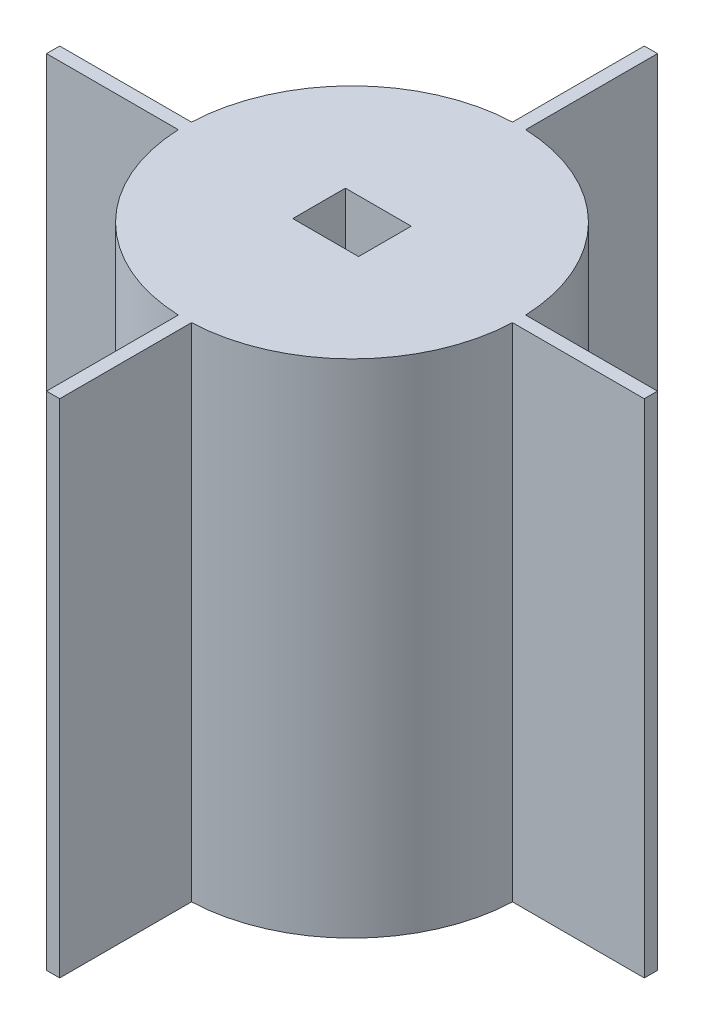
ISO-10303-21;
HEADER;
FILE_DESCRIPTION(('STEP AP214'),'2;1');
FILE_NAME('part.step','',(''),(''),'','','');
FILE_SCHEMA(('AUTOMOTIVE_DESIGN { 1 0 10303 214 1 1 1 1 }'));
ENDSEC;
DATA;
#1=APPLICATION_CONTEXT('core data for automotive mechanical design processes');
#2=APPLICATION_PROTOCOL_DEFINITION('international standard','automotive_design',2000,#1);
#3=PRODUCT_CONTEXT('',#1,'mechanical');
#4=PRODUCT('Part','Part','',(#3));
#5=PRODUCT_RELATED_PRODUCT_CATEGORY('part','',(#4));
#6=PRODUCT_DEFINITION_FORMATION('','',#4);
#7=PRODUCT_DEFINITION_CONTEXT('part definition',#1,'design');
#8=PRODUCT_DEFINITION('design','',#6,#7);
#9=PRODUCT_DEFINITION_SHAPE('','',#8);
#10=(LENGTH_UNIT() NAMED_UNIT(*) SI_UNIT(.MILLI.,.METRE.));
#11=(NAMED_UNIT(*) PLANE_ANGLE_UNIT() SI_UNIT($,.RADIAN.));
#12=(NAMED_UNIT(*) SI_UNIT($,.STERADIAN.) SOLID_ANGLE_UNIT());
#13=UNCERTAINTY_MEASURE_WITH_UNIT(LENGTH_MEASURE(1.E-05),#10,'distance_accuracy_value','');
#14=(GEOMETRIC_REPRESENTATION_CONTEXT(3) GLOBAL_UNCERTAINTY_ASSIGNED_CONTEXT((#13)) GLOBAL_UNIT_ASSIGNED_CONTEXT((#10,
#11,#12)) REPRESENTATION_CONTEXT('',''));
#15=CARTESIAN_POINT('',(0.,0.,0.));
#16=DIRECTION('',(0.,0.,1.));
#17=DIRECTION('',(1.,0.,0.));
#18=AXIS2_PLACEMENT_3D('',#15,#16,#17);
#19=CARTESIAN_POINT('',(0.,38.1,0.));
#20=DIRECTION('',(0.,-1.,0.));
#21=DIRECTION('',(0.,0.,-1.));
#22=AXIS2_PLACEMENT_3D('',#19,#20,#21);
#23=CYLINDRICAL_SURFACE('',#22,12.7);
#24=DIRECTION('',(0.,-1.,0.));
#25=VECTOR('',#24,1.);
#26=CARTESIAN_POINT('',(-0.500000000000133,38.1,12.6901536633722));
#27=LINE('',#26,#25);
#28=CARTESIAN_POINT('',(-0.500000000000133,38.1,12.6901536633722));
#29=VERTEX_POINT('',#28);
#30=CARTESIAN_POINT('',(-0.500000000000133,0.,12.6901536633722));
#31=VERTEX_POINT('',#30);
#32=EDGE_CURVE('E70',#29,#31,#27,.T.);
#33=ORIENTED_EDGE('',*,*,#32,.F.);
#34=CARTESIAN_POINT('',(0.,38.1,0.));
#35=DIRECTION('',(0.,1.,0.));
#36=DIRECTION('',(0.,0.,1.));
#37=AXIS2_PLACEMENT_3D('',#34,#35,#36);
#38=CIRCLE('',#37,12.7);
#39=CARTESIAN_POINT('',(-12.6901536633722,38.1,0.5));
#40=VERTEX_POINT('',#39);
#41=EDGE_CURVE('E449',#40,#29,#38,.T.);
#42=ORIENTED_EDGE('',*,*,#41,.F.);
#43=DIRECTION('',(0.,-1.,0.));
#44=VECTOR('',#43,1.);
#45=CARTESIAN_POINT('',(-12.6901536633722,38.1,0.5));
#46=LINE('',#45,#44);
#47=CARTESIAN_POINT('',(-12.6901536633722,0.,0.5));
#48=VERTEX_POINT('',#47);
#49=EDGE_CURVE('E254',#40,#48,#46,.T.);
#50=ORIENTED_EDGE('',*,*,#49,.T.);
#51=CARTESIAN_POINT('',(0.,0.,0.));
#52=DIRECTION('',(0.,1.,0.));
#53=DIRECTION('',(0.,0.,1.));
#54=AXIS2_PLACEMENT_3D('',#51,#52,#53);
#55=CIRCLE('',#54,12.7);
#56=EDGE_CURVE('E455',#48,#31,#55,.T.);
#57=ORIENTED_EDGE('',*,*,#56,.T.);
#58=EDGE_LOOP('',(#33,#42,#50,#57));
#59=FACE_BOUND('',#58,.T.);
#60=ADVANCED_FACE('F45',(#59),#23,.T.);
#61=DIRECTION('',(0.,-1.,0.));
#62=VECTOR('',#61,1.);
#63=CARTESIAN_POINT('',(-12.6901536633722,38.1,-0.5));
#64=LINE('',#63,#62);
#65=CARTESIAN_POINT('',(-12.6901536633722,38.1,-0.5));
#66=VERTEX_POINT('',#65);
#67=CARTESIAN_POINT('',(-12.6901536633722,0.,-0.5));
#68=VERTEX_POINT('',#67);
#69=EDGE_CURVE('E263',#66,#68,#64,.T.);
#70=ORIENTED_EDGE('',*,*,#69,.F.);
#71=CARTESIAN_POINT('',(-0.499999999999955,38.1,-12.6901536633722));
#72=VERTEX_POINT('',#71);
#73=EDGE_CURVE('E55',#72,#66,#38,.T.);
#74=ORIENTED_EDGE('',*,*,#73,.F.);
#75=DIRECTION('',(0.,-1.,0.));
#76=VECTOR('',#75,1.);
#77=CARTESIAN_POINT('',(-0.499999999999955,38.1,-12.6901536633722));
#78=LINE('',#77,#76);
#79=CARTESIAN_POINT('',(-0.499999999999955,0.,-12.6901536633722));
#80=VERTEX_POINT('',#79);
#81=EDGE_CURVE('E290',#72,#80,#78,.T.);
#82=ORIENTED_EDGE('',*,*,#81,.T.);
#83=EDGE_CURVE('E446',#80,#68,#55,.T.);
#84=ORIENTED_EDGE('',*,*,#83,.T.);
#85=EDGE_LOOP('',(#70,#74,#82,#84));
#86=FACE_BOUND('',#85,.T.);
#87=ADVANCED_FACE('F412',(#86),#23,.T.);
#88=DIRECTION('',(0.,-1.,0.));
#89=VECTOR('',#88,1.);
#90=CARTESIAN_POINT('',(0.500000000000044,38.1,-12.6901536633722));
#91=LINE('',#90,#89);
#92=CARTESIAN_POINT('',(0.500000000000044,38.1,-12.6901536633722));
#93=VERTEX_POINT('',#92);
#94=CARTESIAN_POINT('',(0.500000000000044,0.,-12.6901536633722));
#95=VERTEX_POINT('',#94);
#96=EDGE_CURVE('E299',#93,#95,#91,.T.);
#97=ORIENTED_EDGE('',*,*,#96,.F.);
#98=CARTESIAN_POINT('',(12.6901536633722,38.1,-0.5));
#99=VERTEX_POINT('',#98);
#100=EDGE_CURVE('E11',#99,#93,#38,.T.);
#101=ORIENTED_EDGE('',*,*,#100,.F.);
#102=DIRECTION('',(0.,-1.,0.));
#103=VECTOR('',#102,1.);
#104=CARTESIAN_POINT('',(12.6901536633722,38.1,-0.5));
#105=LINE('',#104,#103);
#106=CARTESIAN_POINT('',(12.6901536633722,0.,-0.5));
#107=VERTEX_POINT('',#106);
#108=EDGE_CURVE('E334',#107,#99,#105,.F.);
#109=ORIENTED_EDGE('',*,*,#108,.F.);
#110=EDGE_CURVE('E49',#107,#95,#55,.T.);
#111=ORIENTED_EDGE('',*,*,#110,.T.);
#112=EDGE_LOOP('',(#97,#101,#109,#111));
#113=FACE_BOUND('',#112,.T.);
#114=ADVANCED_FACE('F417',(#113),#23,.T.);
#115=CARTESIAN_POINT('',(0.499999999999866,38.1,12.6901536633722));
#116=VERTEX_POINT('',#115);
#117=CARTESIAN_POINT('',(12.6901536633722,38.1,0.5));
#118=VERTEX_POINT('',#117);
#119=EDGE_CURVE('E56',#116,#118,#38,.T.);
#120=ORIENTED_EDGE('',*,*,#119,.F.);
#121=DIRECTION('',(0.,-1.,0.));
#122=VECTOR('',#121,1.);
#123=CARTESIAN_POINT('',(0.499999999999866,38.1,12.6901536633722));
#124=LINE('',#123,#122);
#125=CARTESIAN_POINT('',(0.499999999999866,0.,12.6901536633722));
#126=VERTEX_POINT('',#125);
#127=EDGE_CURVE('E223',#116,#126,#124,.T.);
#128=ORIENTED_EDGE('',*,*,#127,.T.);
#129=CARTESIAN_POINT('',(12.6901536633722,0.,0.5));
#130=VERTEX_POINT('',#129);
#131=EDGE_CURVE('E192',#126,#130,#55,.T.);
#132=ORIENTED_EDGE('',*,*,#131,.T.);
#133=DIRECTION('',(0.,-1.,0.));
#134=VECTOR('',#133,1.);
#135=CARTESIAN_POINT('',(12.6901536633722,38.1,0.5));
#136=LINE('',#135,#134);
#137=EDGE_CURVE('E331',#130,#118,#136,.F.);
#138=ORIENTED_EDGE('',*,*,#137,.T.);
#139=EDGE_LOOP('',(#120,#128,#132,#138));
#140=FACE_BOUND('',#139,.T.);
#141=ADVANCED_FACE('F47',(#140),#23,.T.);
#142=CARTESIAN_POINT('',(0.,38.1,0.));
#143=DIRECTION('',(0.,1.,0.));
#144=DIRECTION('',(0.,0.,1.));
#145=AXIS2_PLACEMENT_3D('',#142,#143,#144);
#146=PLANE('',#145);
#147=ORIENTED_EDGE('',*,*,#41,.T.);
#148=DIRECTION('',(0.,0.,-1.));
#149=VECTOR('',#148,1.);
#150=CARTESIAN_POINT('',(-0.500000000000238,38.1,22.7));
#151=LINE('',#150,#149);
#152=CARTESIAN_POINT('',(-0.500000000000238,38.1,22.7));
#153=VERTEX_POINT('',#152);
#154=EDGE_CURVE('E214',#153,#29,#151,.T.);
#155=ORIENTED_EDGE('',*,*,#154,.F.);
#156=DIRECTION('',(-1.,0.,0.));
#157=VECTOR('',#156,1.);
#158=CARTESIAN_POINT('',(0.499999999999761,38.1,22.7));
#159=LINE('',#158,#157);
#160=CARTESIAN_POINT('',(0.499999999999761,38.1,22.7));
#161=VERTEX_POINT('',#160);
#162=EDGE_CURVE('E221',#161,#153,#159,.T.);
#163=ORIENTED_EDGE('',*,*,#162,.F.);
#164=DIRECTION('',(0.,0.,-1.));
#165=VECTOR('',#164,1.);
#166=CARTESIAN_POINT('',(0.499999999999761,38.1,22.7));
#167=LINE('',#166,#165);
#168=EDGE_CURVE('E209',#161,#116,#167,.T.);
#169=ORIENTED_EDGE('',*,*,#168,.T.);
#170=ORIENTED_EDGE('',*,*,#119,.T.);
#171=DIRECTION('',(1.,0.,0.));
#172=VECTOR('',#171,1.);
#173=CARTESIAN_POINT('',(2.5,38.1,0.5));
#174=LINE('',#173,#172);
#175=CARTESIAN_POINT('',(22.7,38.1,0.5));
#176=VERTEX_POINT('',#175);
#177=EDGE_CURVE('E319',#118,#176,#174,.T.);
#178=ORIENTED_EDGE('',*,*,#177,.T.);
#179=DIRECTION('',(0.,0.,-1.));
#180=VECTOR('',#179,1.);
#181=CARTESIAN_POINT('',(22.7,38.1,0.5));
#182=LINE('',#181,#180);
#183=CARTESIAN_POINT('',(22.7,38.1,-0.5));
#184=VERTEX_POINT('',#183);
#185=EDGE_CURVE('E315',#176,#184,#182,.T.);
#186=ORIENTED_EDGE('',*,*,#185,.T.);
#187=DIRECTION('',(1.,0.,0.));
#188=VECTOR('',#187,1.);
#189=CARTESIAN_POINT('',(2.5,38.1,-0.5));
#190=LINE('',#189,#188);
#191=EDGE_CURVE('E303',#99,#184,#190,.T.);
#192=ORIENTED_EDGE('',*,*,#191,.F.);
#193=ORIENTED_EDGE('',*,*,#100,.T.);
#194=DIRECTION('',(0.,0.,1.));
#195=VECTOR('',#194,1.);
#196=CARTESIAN_POINT('',(0.500000000000079,38.1,-22.7));
#197=LINE('',#196,#195);
#198=CARTESIAN_POINT('',(0.500000000000079,38.1,-22.7));
#199=VERTEX_POINT('',#198);
#200=EDGE_CURVE('E282',#199,#93,#197,.T.);
#201=ORIENTED_EDGE('',*,*,#200,.F.);
#202=DIRECTION('',(1.,0.,0.));
#203=VECTOR('',#202,1.);
#204=CARTESIAN_POINT('',(-0.49999999999992,38.1,-22.7));
#205=LINE('',#204,#203);
#206=CARTESIAN_POINT('',(-0.49999999999992,38.1,-22.7));
#207=VERTEX_POINT('',#206);
#208=EDGE_CURVE('E286',#207,#199,#205,.T.);
#209=ORIENTED_EDGE('',*,*,#208,.F.);
#210=DIRECTION('',(0.,0.,1.));
#211=VECTOR('',#210,1.);
#212=CARTESIAN_POINT('',(-0.49999999999992,38.1,-22.7));
#213=LINE('',#212,#211);
#214=EDGE_CURVE('E278',#207,#72,#213,.T.);
#215=ORIENTED_EDGE('',*,*,#214,.T.);
#216=ORIENTED_EDGE('',*,*,#73,.T.);
#217=DIRECTION('',(1.,0.,0.));
#218=VECTOR('',#217,1.);
#219=CARTESIAN_POINT('',(-22.7,38.1,-0.5));
#220=LINE('',#219,#218);
#221=CARTESIAN_POINT('',(-22.7,38.1,-0.5));
#222=VERTEX_POINT('',#221);
#223=EDGE_CURVE('E246',#222,#66,#220,.T.);
#224=ORIENTED_EDGE('',*,*,#223,.F.);
#225=DIRECTION('',(0.,0.,-1.));
#226=VECTOR('',#225,1.);
#227=CARTESIAN_POINT('',(-22.7,38.1,0.5));
#228=LINE('',#227,#226);
#229=CARTESIAN_POINT('',(-22.7,38.1,0.5));
#230=VERTEX_POINT('',#229);
#231=EDGE_CURVE('E250',#230,#222,#228,.T.);
#232=ORIENTED_EDGE('',*,*,#231,.F.);
#233=DIRECTION('',(1.,0.,0.));
#234=VECTOR('',#233,1.);
#235=CARTESIAN_POINT('',(-22.7,38.1,0.5));
#236=LINE('',#235,#234);
#237=EDGE_CURVE('E242',#230,#40,#236,.T.);
#238=ORIENTED_EDGE('',*,*,#237,.T.);
#239=EDGE_LOOP('',(#147,#155,#163,#169,#170,#178,#186,#192,#193,#201,#209,#215,#216,#224,#232,#238));
#240=FACE_BOUND('',#239,.T.);
#241=DIRECTION('',(1.,0.,0.));
#242=VECTOR('',#241,1.);
#243=CARTESIAN_POINT('',(2.5,38.1,2.000000064));
#244=LINE('',#243,#242);
#245=CARTESIAN_POINT('',(-2.5,38.1,2.000000064));
#246=VERTEX_POINT('',#245);
#247=CARTESIAN_POINT('',(2.5,38.1,2.000000064));
#248=VERTEX_POINT('',#247);
#249=EDGE_CURVE('E357',#246,#248,#244,.T.);
#250=ORIENTED_EDGE('',*,*,#249,.F.);
#251=DIRECTION('',(0.,0.,1.));
#252=VECTOR('',#251,1.);
#253=CARTESIAN_POINT('',(-2.5,38.1,2.000000064));
#254=LINE('',#253,#252);
#255=CARTESIAN_POINT('',(-2.5,38.1,-2.000000064));
#256=VERTEX_POINT('',#255);
#257=EDGE_CURVE('E338',#256,#246,#254,.T.);
#258=ORIENTED_EDGE('',*,*,#257,.F.);
#259=DIRECTION('',(-1.,0.,0.));
#260=VECTOR('',#259,1.);
#261=CARTESIAN_POINT('',(2.5,38.1,-2.000000064));
#262=LINE('',#261,#260);
#263=CARTESIAN_POINT('',(2.5,38.1,-2.000000064));
#264=VERTEX_POINT('',#263);
#265=EDGE_CURVE('E343',#264,#256,#262,.T.);
#266=ORIENTED_EDGE('',*,*,#265,.F.);
#267=DIRECTION('',(0.,0.,-1.));
#268=VECTOR('',#267,1.);
#269=CARTESIAN_POINT('',(2.5,38.1,2.000000064));
#270=LINE('',#269,#268);
#271=EDGE_CURVE('E361',#248,#264,#270,.T.);
#272=ORIENTED_EDGE('',*,*,#271,.F.);
#273=EDGE_LOOP('',(#250,#258,#266,#272));
#274=FACE_BOUND('',#273,.T.);
#275=ADVANCED_FACE('F389',(#240,#274),#146,.T.);
#276=CARTESIAN_POINT('',(0.,0.,0.));
#277=DIRECTION('',(0.,1.,0.));
#278=DIRECTION('',(0.,0.,1.));
#279=AXIS2_PLACEMENT_3D('',#276,#277,#278);
#280=PLANE('',#279);
#281=ORIENTED_EDGE('',*,*,#131,.F.);
#282=DIRECTION('',(0.,0.,1.));
#283=VECTOR('',#282,1.);
#284=CARTESIAN_POINT('',(0.499999999999761,0.,22.7));
#285=LINE('',#284,#283);
#286=CARTESIAN_POINT('',(0.499999999999761,0.,22.7));
#287=VERTEX_POINT('',#286);
#288=EDGE_CURVE('E185',#126,#287,#285,.T.);
#289=ORIENTED_EDGE('',*,*,#288,.T.);
#290=DIRECTION('',(1.,0.,0.));
#291=VECTOR('',#290,1.);
#292=CARTESIAN_POINT('',(0.499999999999761,0.,22.7));
#293=LINE('',#292,#291);
#294=CARTESIAN_POINT('',(-0.500000000000238,0.,22.7));
#295=VERTEX_POINT('',#294);
#296=EDGE_CURVE('E189',#295,#287,#293,.T.);
#297=ORIENTED_EDGE('',*,*,#296,.F.);
#298=DIRECTION('',(0.,0.,1.));
#299=VECTOR('',#298,1.);
#300=CARTESIAN_POINT('',(-0.500000000000238,0.,22.7));
#301=LINE('',#300,#299);
#302=EDGE_CURVE('E204',#31,#295,#301,.T.);
#303=ORIENTED_EDGE('',*,*,#302,.F.);
#304=ORIENTED_EDGE('',*,*,#56,.F.);
#305=DIRECTION('',(-1.,0.,0.));
#306=VECTOR('',#305,1.);
#307=CARTESIAN_POINT('',(-22.7,0.,0.5));
#308=LINE('',#307,#306);
#309=CARTESIAN_POINT('',(-22.7,0.,0.5));
#310=VERTEX_POINT('',#309);
#311=EDGE_CURVE('E231',#48,#310,#308,.T.);
#312=ORIENTED_EDGE('',*,*,#311,.T.);
#313=DIRECTION('',(0.,0.,1.));
#314=VECTOR('',#313,1.);
#315=CARTESIAN_POINT('',(-22.7,0.,0.5));
#316=LINE('',#315,#314);
#317=CARTESIAN_POINT('',(-22.7,0.,-0.5));
#318=VERTEX_POINT('',#317);
#319=EDGE_CURVE('E234',#318,#310,#316,.T.);
#320=ORIENTED_EDGE('',*,*,#319,.F.);
#321=DIRECTION('',(-1.,0.,0.));
#322=VECTOR('',#321,1.);
#323=CARTESIAN_POINT('',(-22.7,0.,-0.5));
#324=LINE('',#323,#322);
#325=EDGE_CURVE('E239',#68,#318,#324,.T.);
#326=ORIENTED_EDGE('',*,*,#325,.F.);
#327=ORIENTED_EDGE('',*,*,#83,.F.);
#328=DIRECTION('',(0.,0.,-1.));
#329=VECTOR('',#328,1.);
#330=CARTESIAN_POINT('',(-0.49999999999992,0.,-22.7));
#331=LINE('',#330,#329);
#332=CARTESIAN_POINT('',(-0.49999999999992,0.,-22.7));
#333=VERTEX_POINT('',#332);
#334=EDGE_CURVE('E267',#80,#333,#331,.T.);
#335=ORIENTED_EDGE('',*,*,#334,.T.);
#336=DIRECTION('',(-1.,0.,0.));
#337=VECTOR('',#336,1.);
#338=CARTESIAN_POINT('',(-0.49999999999992,0.,-22.7));
#339=LINE('',#338,#337);
#340=CARTESIAN_POINT('',(0.500000000000079,0.,-22.7));
#341=VERTEX_POINT('',#340);
#342=EDGE_CURVE('E270',#341,#333,#339,.T.);
#343=ORIENTED_EDGE('',*,*,#342,.F.);
#344=DIRECTION('',(0.,0.,-1.));
#345=VECTOR('',#344,1.);
#346=CARTESIAN_POINT('',(0.500000000000079,0.,-22.7));
#347=LINE('',#346,#345);
#348=EDGE_CURVE('E275',#95,#341,#347,.T.);
#349=ORIENTED_EDGE('',*,*,#348,.F.);
#350=ORIENTED_EDGE('',*,*,#110,.F.);
#351=DIRECTION('',(-1.,0.,0.));
#352=VECTOR('',#351,1.);
#353=CARTESIAN_POINT('',(2.5,0.,-0.5));
#354=LINE('',#353,#352);
#355=CARTESIAN_POINT('',(22.7,0.,-0.5));
#356=VERTEX_POINT('',#355);
#357=EDGE_CURVE('E307',#356,#107,#354,.T.);
#358=ORIENTED_EDGE('',*,*,#357,.F.);
#359=DIRECTION('',(0.,0.,1.));
#360=VECTOR('',#359,1.);
#361=CARTESIAN_POINT('',(22.7,0.,0.5));
#362=LINE('',#361,#360);
#363=CARTESIAN_POINT('',(22.7,0.,0.5));
#364=VERTEX_POINT('',#363);
#365=EDGE_CURVE('E304',#356,#364,#362,.T.);
#366=ORIENTED_EDGE('',*,*,#365,.T.);
#367=DIRECTION('',(-1.,0.,0.));
#368=VECTOR('',#367,1.);
#369=CARTESIAN_POINT('',(2.5,0.,0.5));
#370=LINE('',#369,#368);
#371=EDGE_CURVE('E312',#364,#130,#370,.T.);
#372=ORIENTED_EDGE('',*,*,#371,.T.);
#373=EDGE_LOOP('',(#281,#289,#297,#303,#304,#312,#320,#326,#327,#335,#343,#349,#350,#358,#366,#372));
#374=FACE_BOUND('',#373,.T.);
#375=ADVANCED_FACE('F187',(#374),#280,.F.);
#376=CARTESIAN_POINT('',(-2.5,30.1,2.000000064));
#377=DIRECTION('',(-1.,0.,0.));
#378=DIRECTION('',(0.,0.,1.));
#379=AXIS2_PLACEMENT_3D('',#376,#377,#378);
#380=PLANE('',#379);
#381=DIRECTION('',(0.,1.,0.));
#382=VECTOR('',#381,1.);
#383=CARTESIAN_POINT('',(-2.5,30.1,2.000000064));
#384=LINE('',#383,#382);
#385=CARTESIAN_POINT('',(-2.5,30.1,2.000000064));
#386=VERTEX_POINT('',#385);
#387=EDGE_CURVE('E354',#386,#246,#384,.T.);
#388=ORIENTED_EDGE('',*,*,#387,.F.);
#389=DIRECTION('',(0.,0.,1.));
#390=VECTOR('',#389,1.);
#391=CARTESIAN_POINT('',(-2.5,30.1,2.000000064));
#392=LINE('',#391,#390);
#393=CARTESIAN_POINT('',(-2.5,30.1,-2.000000064));
#394=VERTEX_POINT('',#393);
#395=EDGE_CURVE('E339',#394,#386,#392,.T.);
#396=ORIENTED_EDGE('',*,*,#395,.F.);
#397=DIRECTION('',(0.,1.,0.));
#398=VECTOR('',#397,1.);
#399=CARTESIAN_POINT('',(-2.5,30.1,-2.000000064));
#400=LINE('',#399,#398);
#401=EDGE_CURVE('E367',#394,#256,#400,.T.);
#402=ORIENTED_EDGE('',*,*,#401,.T.);
#403=ORIENTED_EDGE('',*,*,#257,.T.);
#404=EDGE_LOOP('',(#388,#396,#402,#403));
#405=FACE_BOUND('',#404,.T.);
#406=ADVANCED_FACE('F400',(#405),#380,.F.);
#407=CARTESIAN_POINT('',(2.5,30.1,-2.000000064));
#408=DIRECTION('',(0.,0.,-1.));
#409=DIRECTION('',(-1.,0.,0.));
#410=AXIS2_PLACEMENT_3D('',#407,#408,#409);
#411=PLANE('',#410);
#412=ORIENTED_EDGE('',*,*,#265,.T.);
#413=ORIENTED_EDGE('',*,*,#401,.F.);
#414=DIRECTION('',(-1.,0.,0.));
#415=VECTOR('',#414,1.);
#416=CARTESIAN_POINT('',(2.5,30.1,-2.000000064));
#417=LINE('',#416,#415);
#418=CARTESIAN_POINT('',(2.5,30.1,-2.000000064));
#419=VERTEX_POINT('',#418);
#420=EDGE_CURVE('E350',#419,#394,#417,.T.);
#421=ORIENTED_EDGE('',*,*,#420,.F.);
#422=DIRECTION('',(0.,1.,0.));
#423=VECTOR('',#422,1.);
#424=CARTESIAN_POINT('',(2.5,30.1,-2.000000064));
#425=LINE('',#424,#423);
#426=EDGE_CURVE('E370',#419,#264,#425,.T.);
#427=ORIENTED_EDGE('',*,*,#426,.T.);
#428=EDGE_LOOP('',(#412,#413,#421,#427));
#429=FACE_BOUND('',#428,.T.);
#430=ADVANCED_FACE('F397',(#429),#411,.F.);
#431=CARTESIAN_POINT('',(2.5,30.1,2.000000064));
#432=DIRECTION('',(1.,0.,0.));
#433=DIRECTION('',(0.,0.,-1.));
#434=AXIS2_PLACEMENT_3D('',#431,#432,#433);
#435=PLANE('',#434);
#436=ORIENTED_EDGE('',*,*,#271,.T.);
#437=ORIENTED_EDGE('',*,*,#426,.F.);
#438=DIRECTION('',(0.,0.,-1.));
#439=VECTOR('',#438,1.);
#440=CARTESIAN_POINT('',(2.5,30.1,2.000000064));
#441=LINE('',#440,#439);
#442=CARTESIAN_POINT('',(2.5,30.1,2.000000064));
#443=VERTEX_POINT('',#442);
#444=EDGE_CURVE('E347',#443,#419,#441,.T.);
#445=ORIENTED_EDGE('',*,*,#444,.F.);
#446=DIRECTION('',(0.,1.,0.));
#447=VECTOR('',#446,1.);
#448=CARTESIAN_POINT('',(2.5,30.1,2.000000064));
#449=LINE('',#448,#447);
#450=EDGE_CURVE('E374',#443,#248,#449,.T.);
#451=ORIENTED_EDGE('',*,*,#450,.T.);
#452=EDGE_LOOP('',(#436,#437,#445,#451));
#453=FACE_BOUND('',#452,.T.);
#454=ADVANCED_FACE('F393',(#453),#435,.F.);
#455=CARTESIAN_POINT('',(2.5,30.1,2.000000064));
#456=DIRECTION('',(0.,0.,1.));
#457=DIRECTION('',(1.,0.,0.));
#458=AXIS2_PLACEMENT_3D('',#455,#456,#457);
#459=PLANE('',#458);
#460=ORIENTED_EDGE('',*,*,#249,.T.);
#461=ORIENTED_EDGE('',*,*,#450,.F.);
#462=DIRECTION('',(1.,0.,0.));
#463=VECTOR('',#462,1.);
#464=CARTESIAN_POINT('',(2.5,30.1,2.000000064));
#465=LINE('',#464,#463);
#466=EDGE_CURVE('E342',#386,#443,#465,.T.);
#467=ORIENTED_EDGE('',*,*,#466,.F.);
#468=ORIENTED_EDGE('',*,*,#387,.T.);
#469=EDGE_LOOP('',(#460,#461,#467,#468));
#470=FACE_BOUND('',#469,.T.);
#471=ADVANCED_FACE('F383',(#470),#459,.F.);
#472=CARTESIAN_POINT('',(0.,30.1,0.));
#473=DIRECTION('',(0.,1.,0.));
#474=DIRECTION('',(0.,0.,1.));
#475=AXIS2_PLACEMENT_3D('',#472,#473,#474);
#476=PLANE('',#475);
#477=ORIENTED_EDGE('',*,*,#395,.T.);
#478=ORIENTED_EDGE('',*,*,#466,.T.);
#479=ORIENTED_EDGE('',*,*,#444,.T.);
#480=ORIENTED_EDGE('',*,*,#420,.T.);
#481=EDGE_LOOP('',(#477,#478,#479,#480));
#482=FACE_BOUND('',#481,.T.);
#483=ADVANCED_FACE('F399',(#482),#476,.T.);
#484=CARTESIAN_POINT('',(2.5,-20.2247373283314,-0.5));
#485=DIRECTION('',(0.,0.,1.));
#486=DIRECTION('',(1.,0.,0.));
#487=AXIS2_PLACEMENT_3D('',#484,#485,#486);
#488=PLANE('',#487);
#489=ORIENTED_EDGE('',*,*,#357,.T.);
#490=ORIENTED_EDGE('',*,*,#108,.T.);
#491=ORIENTED_EDGE('',*,*,#191,.T.);
#492=DIRECTION('',(0.,1.,0.));
#493=VECTOR('',#492,1.);
#494=CARTESIAN_POINT('',(22.7,-20.2247373283314,-0.5));
#495=LINE('',#494,#493);
#496=EDGE_CURVE('E308',#356,#184,#495,.T.);
#497=ORIENTED_EDGE('',*,*,#496,.F.);
#498=EDGE_LOOP('',(#489,#490,#491,#497));
#499=FACE_BOUND('',#498,.T.);
#500=ADVANCED_FACE('F493',(#499),#488,.F.);
#501=CARTESIAN_POINT('',(2.5,-20.2247373283314,0.5));
#502=DIRECTION('',(0.,0.,1.));
#503=DIRECTION('',(1.,0.,0.));
#504=AXIS2_PLACEMENT_3D('',#501,#502,#503);
#505=PLANE('',#504);
#506=ORIENTED_EDGE('',*,*,#137,.F.);
#507=ORIENTED_EDGE('',*,*,#371,.F.);
#508=DIRECTION('',(0.,1.,0.));
#509=VECTOR('',#508,1.);
#510=CARTESIAN_POINT('',(22.7,-20.2247373283314,0.5));
#511=LINE('',#510,#509);
#512=EDGE_CURVE('E322',#364,#176,#511,.T.);
#513=ORIENTED_EDGE('',*,*,#512,.T.);
#514=ORIENTED_EDGE('',*,*,#177,.F.);
#515=EDGE_LOOP('',(#506,#507,#513,#514));
#516=FACE_BOUND('',#515,.T.);
#517=ADVANCED_FACE('F490',(#516),#505,.T.);
#518=CARTESIAN_POINT('',(22.7,-20.2247373283314,0.5));
#519=DIRECTION('',(1.,0.,0.));
#520=DIRECTION('',(0.,0.,-1.));
#521=AXIS2_PLACEMENT_3D('',#518,#519,#520);
#522=PLANE('',#521);
#523=ORIENTED_EDGE('',*,*,#365,.F.);
#524=ORIENTED_EDGE('',*,*,#496,.T.);
#525=ORIENTED_EDGE('',*,*,#185,.F.);
#526=ORIENTED_EDGE('',*,*,#512,.F.);
#527=EDGE_LOOP('',(#523,#524,#525,#526));
#528=FACE_BOUND('',#527,.T.);
#529=ADVANCED_FACE('F487',(#528),#522,.T.);
#530=CARTESIAN_POINT('',(0.500000000000079,-20.2247373283314,-22.7));
#531=DIRECTION('',(-1.,0.,0.));
#532=DIRECTION('',(0.,0.,1.));
#533=AXIS2_PLACEMENT_3D('',#530,#531,#532);
#534=PLANE('',#533);
#535=ORIENTED_EDGE('',*,*,#200,.T.);
#536=ORIENTED_EDGE('',*,*,#96,.T.);
#537=ORIENTED_EDGE('',*,*,#348,.T.);
#538=DIRECTION('',(0.,1.,0.));
#539=VECTOR('',#538,1.);
#540=CARTESIAN_POINT('',(0.500000000000079,-20.2247373283314,-22.7));
#541=LINE('',#540,#539);
#542=EDGE_CURVE('E271',#341,#199,#541,.T.);
#543=ORIENTED_EDGE('',*,*,#542,.T.);
#544=EDGE_LOOP('',(#535,#536,#537,#543));
#545=FACE_BOUND('',#544,.T.);
#546=ADVANCED_FACE('F434',(#545),#534,.F.);
#547=CARTESIAN_POINT('',(-0.49999999999992,-20.2247373283314,-22.7));
#548=DIRECTION('',(-1.,0.,0.));
#549=DIRECTION('',(0.,0.,1.));
#550=AXIS2_PLACEMENT_3D('',#547,#548,#549);
#551=PLANE('',#550);
#552=ORIENTED_EDGE('',*,*,#81,.F.);
#553=ORIENTED_EDGE('',*,*,#214,.F.);
#554=DIRECTION('',(0.,1.,0.));
#555=VECTOR('',#554,1.);
#556=CARTESIAN_POINT('',(-0.49999999999992,-20.2247373283314,-22.7));
#557=LINE('',#556,#555);
#558=EDGE_CURVE('E274',#333,#207,#557,.T.);
#559=ORIENTED_EDGE('',*,*,#558,.F.);
#560=ORIENTED_EDGE('',*,*,#334,.F.);
#561=EDGE_LOOP('',(#552,#553,#559,#560));
#562=FACE_BOUND('',#561,.T.);
#563=ADVANCED_FACE('F444',(#562),#551,.T.);
#564=CARTESIAN_POINT('',(-0.49999999999992,-20.2247373283314,-22.7));
#565=DIRECTION('',(0.,0.,1.));
#566=DIRECTION('',(1.,0.,0.));
#567=AXIS2_PLACEMENT_3D('',#564,#565,#566);
#568=PLANE('',#567);
#569=ORIENTED_EDGE('',*,*,#542,.F.);
#570=ORIENTED_EDGE('',*,*,#342,.T.);
#571=ORIENTED_EDGE('',*,*,#558,.T.);
#572=ORIENTED_EDGE('',*,*,#208,.T.);
#573=EDGE_LOOP('',(#569,#570,#571,#572));
#574=FACE_BOUND('',#573,.T.);
#575=ADVANCED_FACE('F438',(#574),#568,.F.);
#576=CARTESIAN_POINT('',(-22.7,-20.2247373283314,-0.5));
#577=DIRECTION('',(0.,0.,1.));
#578=DIRECTION('',(1.,0.,0.));
#579=AXIS2_PLACEMENT_3D('',#576,#577,#578);
#580=PLANE('',#579);
#581=ORIENTED_EDGE('',*,*,#223,.T.);
#582=ORIENTED_EDGE('',*,*,#69,.T.);
#583=ORIENTED_EDGE('',*,*,#325,.T.);
#584=DIRECTION('',(0.,1.,0.));
#585=VECTOR('',#584,1.);
#586=CARTESIAN_POINT('',(-22.7,-20.2247373283314,-0.5));
#587=LINE('',#586,#585);
#588=EDGE_CURVE('E235',#318,#222,#587,.T.);
#589=ORIENTED_EDGE('',*,*,#588,.T.);
#590=EDGE_LOOP('',(#581,#582,#583,#589));
#591=FACE_BOUND('',#590,.T.);
#592=ADVANCED_FACE('F476',(#591),#580,.F.);
#593=CARTESIAN_POINT('',(-22.7,-20.2247373283314,0.5));
#594=DIRECTION('',(0.,0.,1.));
#595=DIRECTION('',(1.,0.,0.));
#596=AXIS2_PLACEMENT_3D('',#593,#594,#595);
#597=PLANE('',#596);
#598=ORIENTED_EDGE('',*,*,#49,.F.);
#599=ORIENTED_EDGE('',*,*,#237,.F.);
#600=DIRECTION('',(0.,1.,0.));
#601=VECTOR('',#600,1.);
#602=CARTESIAN_POINT('',(-22.7,-20.2247373283314,0.5));
#603=LINE('',#602,#601);
#604=EDGE_CURVE('E238',#310,#230,#603,.T.);
#605=ORIENTED_EDGE('',*,*,#604,.F.);
#606=ORIENTED_EDGE('',*,*,#311,.F.);
#607=EDGE_LOOP('',(#598,#599,#605,#606));
#608=FACE_BOUND('',#607,.T.);
#609=ADVANCED_FACE('F471',(#608),#597,.T.);
#610=CARTESIAN_POINT('',(-22.7,-20.2247373283314,0.5));
#611=DIRECTION('',(1.,0.,0.));
#612=DIRECTION('',(0.,0.,-1.));
#613=AXIS2_PLACEMENT_3D('',#610,#611,#612);
#614=PLANE('',#613);
#615=ORIENTED_EDGE('',*,*,#588,.F.);
#616=ORIENTED_EDGE('',*,*,#319,.T.);
#617=ORIENTED_EDGE('',*,*,#604,.T.);
#618=ORIENTED_EDGE('',*,*,#231,.T.);
#619=EDGE_LOOP('',(#615,#616,#617,#618));
#620=FACE_BOUND('',#619,.T.);
#621=ADVANCED_FACE('F464',(#620),#614,.F.);
#622=CARTESIAN_POINT('',(-0.500000000000238,-20.2247373283314,22.7));
#623=DIRECTION('',(1.,0.,0.));
#624=DIRECTION('',(0.,0.,-1.));
#625=AXIS2_PLACEMENT_3D('',#622,#623,#624);
#626=PLANE('',#625);
#627=ORIENTED_EDGE('',*,*,#154,.T.);
#628=ORIENTED_EDGE('',*,*,#32,.T.);
#629=ORIENTED_EDGE('',*,*,#302,.T.);
#630=DIRECTION('',(0.,1.,0.));
#631=VECTOR('',#630,1.);
#632=CARTESIAN_POINT('',(-0.500000000000238,-20.2247373283314,22.7));
#633=LINE('',#632,#631);
#634=EDGE_CURVE('E202',#295,#153,#633,.T.);
#635=ORIENTED_EDGE('',*,*,#634,.T.);
#636=EDGE_LOOP('',(#627,#628,#629,#635));
#637=FACE_BOUND('',#636,.T.);
#638=ADVANCED_FACE('F462',(#637),#626,.F.);
#639=CARTESIAN_POINT('',(0.499999999999761,-20.2247373283314,22.7));
#640=DIRECTION('',(1.,0.,0.));
#641=DIRECTION('',(0.,0.,-1.));
#642=AXIS2_PLACEMENT_3D('',#639,#640,#641);
#643=PLANE('',#642);
#644=ORIENTED_EDGE('',*,*,#127,.F.);
#645=ORIENTED_EDGE('',*,*,#168,.F.);
#646=DIRECTION('',(0.,1.,0.));
#647=VECTOR('',#646,1.);
#648=CARTESIAN_POINT('',(0.499999999999761,-20.2247373283314,22.7));
#649=LINE('',#648,#647);
#650=EDGE_CURVE('E200',#287,#161,#649,.T.);
#651=ORIENTED_EDGE('',*,*,#650,.F.);
#652=ORIENTED_EDGE('',*,*,#288,.F.);
#653=EDGE_LOOP('',(#644,#645,#651,#652));
#654=FACE_BOUND('',#653,.T.);
#655=ADVANCED_FACE('F207',(#654),#643,.T.);
#656=CARTESIAN_POINT('',(0.499999999999761,-20.2247373283314,22.7));
#657=DIRECTION('',(0.,0.,-1.));
#658=DIRECTION('',(-1.,0.,0.));
#659=AXIS2_PLACEMENT_3D('',#656,#657,#658);
#660=PLANE('',#659);
#661=ORIENTED_EDGE('',*,*,#634,.F.);
#662=ORIENTED_EDGE('',*,*,#296,.T.);
#663=ORIENTED_EDGE('',*,*,#650,.T.);
#664=ORIENTED_EDGE('',*,*,#162,.T.);
#665=EDGE_LOOP('',(#661,#662,#663,#664));
#666=FACE_BOUND('',#665,.T.);
#667=ADVANCED_FACE('F198',(#666),#660,.F.);
#668=CLOSED_SHELL('',(#60,#87,#114,#141,#275,#375,#406,#430,#454,#471,#483,#500,#517,#529,#546,
#563,#575,#592,#609,#621,#638,#655,#667));
#669=MANIFOLD_SOLID_BREP('B2',#668);
#670=ADVANCED_BREP_SHAPE_REPRESENTATION('',(#18,#669),#14);
#671=SHAPE_DEFINITION_REPRESENTATION(#9,#670);
ENDSEC;
END-ISO-10303-21;
